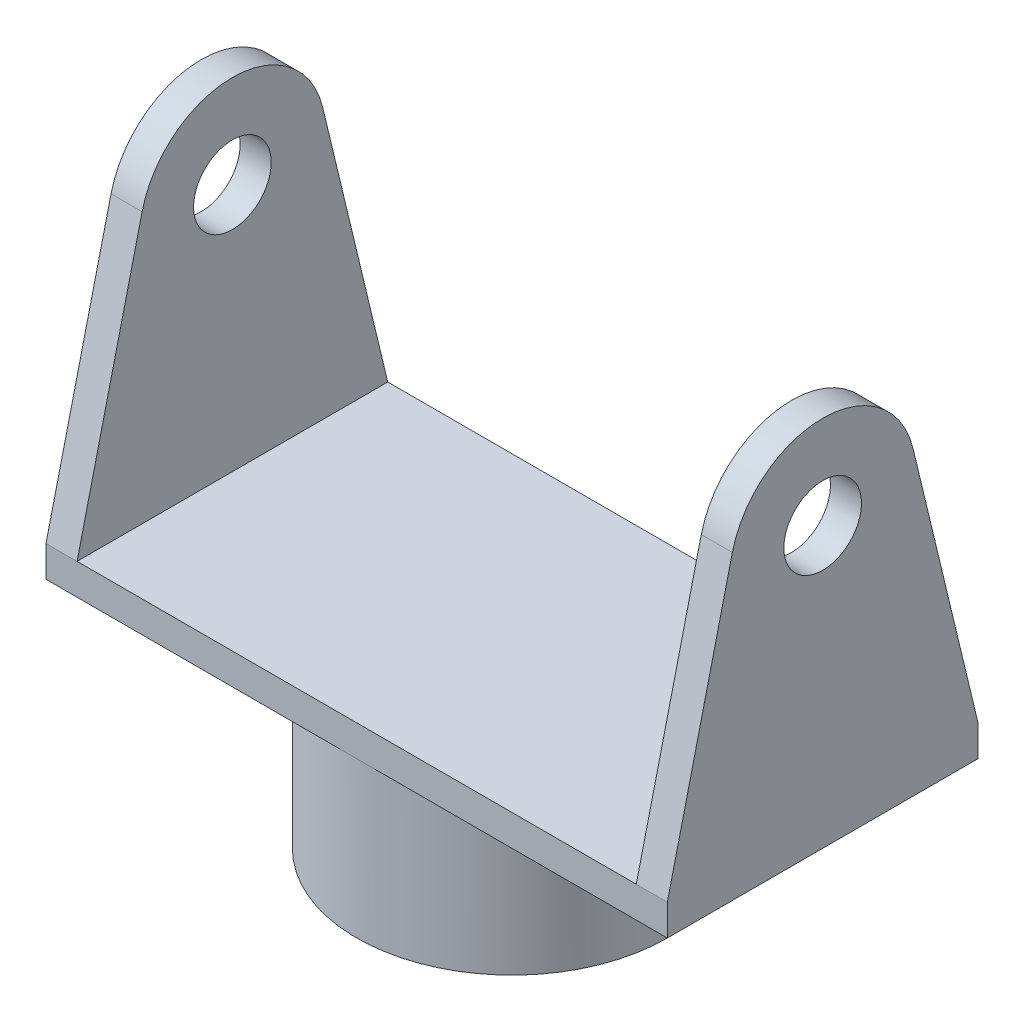
ISO-10303-21;
HEADER;
FILE_DESCRIPTION(('STEP AP214'),'2;1');
FILE_NAME('part.step','',(''),(''),'','','');
FILE_SCHEMA(('AUTOMOTIVE_DESIGN { 1 0 10303 214 1 1 1 1 }'));
ENDSEC;
DATA;
#1=APPLICATION_CONTEXT('core data for automotive mechanical design processes');
#2=APPLICATION_PROTOCOL_DEFINITION('international standard','automotive_design',2000,#1);
#3=PRODUCT_CONTEXT('',#1,'mechanical');
#4=PRODUCT('Part','Part','',(#3));
#5=PRODUCT_RELATED_PRODUCT_CATEGORY('part','',(#4));
#6=PRODUCT_DEFINITION_FORMATION('','',#4);
#7=PRODUCT_DEFINITION_CONTEXT('part definition',#1,'design');
#8=PRODUCT_DEFINITION('design','',#6,#7);
#9=PRODUCT_DEFINITION_SHAPE('','',#8);
#10=(LENGTH_UNIT() NAMED_UNIT(*) SI_UNIT(.MILLI.,.METRE.));
#11=(NAMED_UNIT(*) PLANE_ANGLE_UNIT() SI_UNIT($,.RADIAN.));
#12=(NAMED_UNIT(*) SI_UNIT($,.STERADIAN.) SOLID_ANGLE_UNIT());
#13=UNCERTAINTY_MEASURE_WITH_UNIT(LENGTH_MEASURE(1.E-05),#10,'distance_accuracy_value','');
#14=(GEOMETRIC_REPRESENTATION_CONTEXT(3) GLOBAL_UNCERTAINTY_ASSIGNED_CONTEXT((#13)) GLOBAL_UNIT_ASSIGNED_CONTEXT((#10,
#11,#12)) REPRESENTATION_CONTEXT('',''));
#15=CARTESIAN_POINT('',(0.,0.,0.));
#16=DIRECTION('',(0.,0.,1.));
#17=DIRECTION('',(1.,0.,0.));
#18=AXIS2_PLACEMENT_3D('',#15,#16,#17);
#19=CARTESIAN_POINT('',(0.,0.,0.));
#20=DIRECTION('',(0.,-1.,0.));
#21=DIRECTION('',(1.,0.,0.));
#22=AXIS2_PLACEMENT_3D('',#19,#20,#21);
#23=PLANE('',#22);
#24=DIRECTION('',(0.,0.,-1.));
#25=VECTOR('',#24,1.);
#26=CARTESIAN_POINT('',(-18.,0.,10.));
#27=LINE('',#26,#25);
#28=CARTESIAN_POINT('',(-18.,0.,10.));
#29=VERTEX_POINT('',#28);
#30=CARTESIAN_POINT('',(-18.,0.,-10.));
#31=VERTEX_POINT('',#30);
#32=EDGE_CURVE('E11',#29,#31,#27,.T.);
#33=ORIENTED_EDGE('',*,*,#32,.F.);
#34=DIRECTION('',(-1.,0.,0.));
#35=VECTOR('',#34,1.);
#36=CARTESIAN_POINT('',(-20.,0.,10.));
#37=LINE('',#36,#35);
#38=CARTESIAN_POINT('',(18.,0.,10.));
#39=VERTEX_POINT('',#38);
#40=EDGE_CURVE('E25',#39,#29,#37,.T.);
#41=ORIENTED_EDGE('',*,*,#40,.F.);
#42=DIRECTION('',(0.,0.,-1.));
#43=VECTOR('',#42,1.);
#44=CARTESIAN_POINT('',(18.,0.,10.));
#45=LINE('',#44,#43);
#46=CARTESIAN_POINT('',(18.,0.,-10.));
#47=VERTEX_POINT('',#46);
#48=EDGE_CURVE('E351',#39,#47,#45,.T.);
#49=ORIENTED_EDGE('',*,*,#48,.T.);
#50=DIRECTION('',(1.,0.,0.));
#51=VECTOR('',#50,1.);
#52=CARTESIAN_POINT('',(-20.,0.,-10.));
#53=LINE('',#52,#51);
#54=EDGE_CURVE('E347',#31,#47,#53,.T.);
#55=ORIENTED_EDGE('',*,*,#54,.F.);
#56=EDGE_LOOP('',(#33,#41,#49,#55));
#57=FACE_BOUND('',#56,.T.);
#58=ADVANCED_FACE('F17',(#57),#23,.F.);
#59=CARTESIAN_POINT('',(0.,-2.,0.));
#60=DIRECTION('',(0.,-1.,0.));
#61=DIRECTION('',(1.,0.,0.));
#62=AXIS2_PLACEMENT_3D('',#59,#60,#61);
#63=PLANE('',#62);
#64=CARTESIAN_POINT('',(0.,-2.,0.));
#65=DIRECTION('',(0.,-1.,0.));
#66=DIRECTION('',(1.,0.,0.));
#67=AXIS2_PLACEMENT_3D('',#64,#65,#66);
#68=CIRCLE('',#67,10.);
#69=CARTESIAN_POINT('',(0.,-2.,10.));
#70=VERTEX_POINT('',#69);
#71=CARTESIAN_POINT('',(0.,-2.,-10.));
#72=VERTEX_POINT('',#71);
#73=EDGE_CURVE('E343',#70,#72,#68,.T.);
#74=ORIENTED_EDGE('',*,*,#73,.F.);
#75=DIRECTION('',(-1.,0.,0.));
#76=VECTOR('',#75,1.);
#77=CARTESIAN_POINT('',(-20.,-2.,10.));
#78=LINE('',#77,#76);
#79=CARTESIAN_POINT('',(-20.,-2.,10.));
#80=VERTEX_POINT('',#79);
#81=EDGE_CURVE('E340',#70,#80,#78,.T.);
#82=ORIENTED_EDGE('',*,*,#81,.T.);
#83=DIRECTION('',(0.,0.,-1.));
#84=VECTOR('',#83,1.);
#85=CARTESIAN_POINT('',(-20.,-2.,10.));
#86=LINE('',#85,#84);
#87=CARTESIAN_POINT('',(-20.,-2.,-10.));
#88=VERTEX_POINT('',#87);
#89=EDGE_CURVE('E337',#80,#88,#86,.T.);
#90=ORIENTED_EDGE('',*,*,#89,.T.);
#91=DIRECTION('',(1.,0.,0.));
#92=VECTOR('',#91,1.);
#93=CARTESIAN_POINT('',(-20.,-2.,-10.));
#94=LINE('',#93,#92);
#95=EDGE_CURVE('E334',#88,#72,#94,.T.);
#96=ORIENTED_EDGE('',*,*,#95,.T.);
#97=EDGE_LOOP('',(#74,#82,#90,#96));
#98=FACE_BOUND('',#97,.T.);
#99=ADVANCED_FACE('F394',(#98),#63,.T.);
#100=CARTESIAN_POINT('',(20.,-2.,10.));
#101=DIRECTION('',(-1.,0.,0.));
#102=DIRECTION('',(0.,-1.,0.));
#103=AXIS2_PLACEMENT_3D('',#100,#101,#102);
#104=PLANE('',#103);
#105=DIRECTION('',(0.,1.,0.));
#106=VECTOR('',#105,1.);
#107=CARTESIAN_POINT('',(20.,-2.,-10.));
#108=LINE('',#107,#106);
#109=CARTESIAN_POINT('',(20.,-2.,-10.));
#110=VERTEX_POINT('',#109);
#111=CARTESIAN_POINT('',(20.,0.,-10.));
#112=VERTEX_POINT('',#111);
#113=EDGE_CURVE('E331',#110,#112,#108,.T.);
#114=ORIENTED_EDGE('',*,*,#113,.T.);
#115=DIRECTION('',(0.,0.97224941170306,0.233946749161116));
#116=VECTOR('',#115,1.);
#117=CARTESIAN_POINT('',(20.,0.,-10.));
#118=LINE('',#117,#116);
#119=CARTESIAN_POINT('',(20.,17.3988485893285,-5.81341575770165));
#120=VERTEX_POINT('',#119);
#121=EDGE_CURVE('E328',#112,#120,#118,.T.);
#122=ORIENTED_EDGE('',*,*,#121,.T.);
#123=CARTESIAN_POINT('',(20.,16.,0.));
#124=DIRECTION('',(1.,0.,0.));
#125=DIRECTION('',(0.,0.,1.));
#126=AXIS2_PLACEMENT_3D('',#123,#124,#125);
#127=CIRCLE('',#126,5.97934613045274);
#128=CARTESIAN_POINT('',(20.,17.3988485893285,5.81341575770164));
#129=VERTEX_POINT('',#128);
#130=EDGE_CURVE('E325',#120,#129,#127,.T.);
#131=ORIENTED_EDGE('',*,*,#130,.T.);
#132=DIRECTION('',(0.,-0.97224941170306,0.233946749161116));
#133=VECTOR('',#132,1.);
#134=CARTESIAN_POINT('',(20.,0.,10.));
#135=LINE('',#134,#133);
#136=CARTESIAN_POINT('',(20.,0.,10.));
#137=VERTEX_POINT('',#136);
#138=EDGE_CURVE('E322',#129,#137,#135,.T.);
#139=ORIENTED_EDGE('',*,*,#138,.T.);
#140=DIRECTION('',(0.,1.,0.));
#141=VECTOR('',#140,1.);
#142=CARTESIAN_POINT('',(20.,-2.,10.));
#143=LINE('',#142,#141);
#144=CARTESIAN_POINT('',(20.,-2.,10.));
#145=VERTEX_POINT('',#144);
#146=EDGE_CURVE('E318',#145,#137,#143,.T.);
#147=ORIENTED_EDGE('',*,*,#146,.F.);
#148=DIRECTION('',(0.,0.,1.));
#149=VECTOR('',#148,1.);
#150=CARTESIAN_POINT('',(20.,-2.,10.));
#151=LINE('',#150,#149);
#152=EDGE_CURVE('E314',#110,#145,#151,.T.);
#153=ORIENTED_EDGE('',*,*,#152,.F.);
#154=EDGE_LOOP('',(#114,#122,#131,#139,#147,#153));
#155=FACE_BOUND('',#154,.T.);
#156=CARTESIAN_POINT('',(20.,16.,0.));
#157=DIRECTION('',(1.,0.,0.));
#158=DIRECTION('',(0.,0.,1.));
#159=AXIS2_PLACEMENT_3D('',#156,#157,#158);
#160=CIRCLE('',#159,2.5);
#161=CARTESIAN_POINT('',(20.,16.,2.5));
#162=VERTEX_POINT('',#161);
#163=EDGE_CURVE('E310',#162,#162,#160,.T.);
#164=ORIENTED_EDGE('',*,*,#163,.F.);
#165=EDGE_LOOP('',(#164));
#166=FACE_BOUND('',#165,.T.);
#167=ADVANCED_FACE('F379',(#155,#166),#104,.F.);
#168=CARTESIAN_POINT('',(-20.,-2.,10.));
#169=DIRECTION('',(0.,0.,-1.));
#170=DIRECTION('',(0.,1.,0.));
#171=AXIS2_PLACEMENT_3D('',#168,#169,#170);
#172=PLANE('',#171);
#173=DIRECTION('',(-1.,0.,0.));
#174=VECTOR('',#173,1.);
#175=CARTESIAN_POINT('',(-20.,0.,10.));
#176=LINE('',#175,#174);
#177=EDGE_CURVE('E307',#137,#39,#176,.T.);
#178=ORIENTED_EDGE('',*,*,#177,.T.);
#179=ORIENTED_EDGE('',*,*,#40,.T.);
#180=DIRECTION('',(-1.,0.,0.));
#181=VECTOR('',#180,1.);
#182=CARTESIAN_POINT('',(-18.,0.,10.));
#183=LINE('',#182,#181);
#184=CARTESIAN_POINT('',(-20.,0.,10.));
#185=VERTEX_POINT('',#184);
#186=EDGE_CURVE('E174',#29,#185,#183,.T.);
#187=ORIENTED_EDGE('',*,*,#186,.T.);
#188=DIRECTION('',(0.,1.,0.));
#189=VECTOR('',#188,1.);
#190=CARTESIAN_POINT('',(-20.,-2.,10.));
#191=LINE('',#190,#189);
#192=EDGE_CURVE('E301',#80,#185,#191,.T.);
#193=ORIENTED_EDGE('',*,*,#192,.F.);
#194=ORIENTED_EDGE('',*,*,#81,.F.);
#195=DIRECTION('',(-1.,0.,0.));
#196=VECTOR('',#195,1.);
#197=CARTESIAN_POINT('',(-20.,-2.,10.));
#198=LINE('',#197,#196);
#199=EDGE_CURVE('E297',#145,#70,#198,.T.);
#200=ORIENTED_EDGE('',*,*,#199,.F.);
#201=ORIENTED_EDGE('',*,*,#146,.T.);
#202=EDGE_LOOP('',(#178,#179,#187,#193,#194,#200,#201));
#203=FACE_BOUND('',#202,.T.);
#204=ADVANCED_FACE('F356',(#203),#172,.F.);
#205=CARTESIAN_POINT('',(-20.,-2.,10.));
#206=DIRECTION('',(1.,0.,0.));
#207=DIRECTION('',(0.,0.,1.));
#208=AXIS2_PLACEMENT_3D('',#205,#206,#207);
#209=PLANE('',#208);
#210=ORIENTED_EDGE('',*,*,#192,.T.);
#211=DIRECTION('',(0.,-0.97224941170306,0.233946749161116));
#212=VECTOR('',#211,1.);
#213=CARTESIAN_POINT('',(-20.,0.,10.));
#214=LINE('',#213,#212);
#215=CARTESIAN_POINT('',(-20.,17.3988485893285,5.81341575770164));
#216=VERTEX_POINT('',#215);
#217=EDGE_CURVE('E294',#216,#185,#214,.T.);
#218=ORIENTED_EDGE('',*,*,#217,.F.);
#219=CARTESIAN_POINT('',(-20.,16.,0.));
#220=DIRECTION('',(1.,0.,0.));
#221=DIRECTION('',(0.,0.,1.));
#222=AXIS2_PLACEMENT_3D('',#219,#220,#221);
#223=CIRCLE('',#222,5.97934613045274);
#224=CARTESIAN_POINT('',(-20.,17.3988485893285,-5.81341575770165));
#225=VERTEX_POINT('',#224);
#226=EDGE_CURVE('E179',#225,#216,#223,.T.);
#227=ORIENTED_EDGE('',*,*,#226,.F.);
#228=DIRECTION('',(0.,0.97224941170306,0.233946749161116));
#229=VECTOR('',#228,1.);
#230=CARTESIAN_POINT('',(-20.,0.,-10.));
#231=LINE('',#230,#229);
#232=CARTESIAN_POINT('',(-20.,0.,-10.));
#233=VERTEX_POINT('',#232);
#234=EDGE_CURVE('E288',#233,#225,#231,.T.);
#235=ORIENTED_EDGE('',*,*,#234,.F.);
#236=DIRECTION('',(0.,1.,0.));
#237=VECTOR('',#236,1.);
#238=CARTESIAN_POINT('',(-20.,-2.,-10.));
#239=LINE('',#238,#237);
#240=EDGE_CURVE('E284',#88,#233,#239,.T.);
#241=ORIENTED_EDGE('',*,*,#240,.F.);
#242=ORIENTED_EDGE('',*,*,#89,.F.);
#243=EDGE_LOOP('',(#210,#218,#227,#235,#241,#242));
#244=FACE_BOUND('',#243,.T.);
#245=CARTESIAN_POINT('',(-20.,16.,0.));
#246=DIRECTION('',(1.,0.,0.));
#247=DIRECTION('',(0.,0.,1.));
#248=AXIS2_PLACEMENT_3D('',#245,#246,#247);
#249=CIRCLE('',#248,2.5);
#250=CARTESIAN_POINT('',(-20.,16.,2.5));
#251=VERTEX_POINT('',#250);
#252=EDGE_CURVE('E280',#251,#251,#249,.T.);
#253=ORIENTED_EDGE('',*,*,#252,.T.);
#254=EDGE_LOOP('',(#253));
#255=FACE_BOUND('',#254,.T.);
#256=ADVANCED_FACE('F406',(#244,#255),#209,.F.);
#257=CARTESIAN_POINT('',(-20.,-2.,-10.));
#258=DIRECTION('',(0.,0.,1.));
#259=DIRECTION('',(0.,-1.,0.));
#260=AXIS2_PLACEMENT_3D('',#257,#258,#259);
#261=PLANE('',#260);
#262=DIRECTION('',(1.,0.,0.));
#263=VECTOR('',#262,1.);
#264=CARTESIAN_POINT('',(-20.,0.,-10.));
#265=LINE('',#264,#263);
#266=EDGE_CURVE('E276',#233,#31,#265,.T.);
#267=ORIENTED_EDGE('',*,*,#266,.T.);
#268=ORIENTED_EDGE('',*,*,#54,.T.);
#269=DIRECTION('',(1.,0.,0.));
#270=VECTOR('',#269,1.);
#271=CARTESIAN_POINT('',(18.,0.,-10.));
#272=LINE('',#271,#270);
#273=EDGE_CURVE('E272',#47,#112,#272,.T.);
#274=ORIENTED_EDGE('',*,*,#273,.T.);
#275=ORIENTED_EDGE('',*,*,#113,.F.);
#276=DIRECTION('',(1.,0.,0.));
#277=VECTOR('',#276,1.);
#278=CARTESIAN_POINT('',(-20.,-2.,-10.));
#279=LINE('',#278,#277);
#280=EDGE_CURVE('E268',#72,#110,#279,.T.);
#281=ORIENTED_EDGE('',*,*,#280,.F.);
#282=ORIENTED_EDGE('',*,*,#95,.F.);
#283=ORIENTED_EDGE('',*,*,#240,.T.);
#284=EDGE_LOOP('',(#267,#268,#274,#275,#281,#282,#283));
#285=FACE_BOUND('',#284,.T.);
#286=ADVANCED_FACE('F371',(#285),#261,.F.);
#287=CARTESIAN_POINT('',(0.,-2.,0.));
#288=DIRECTION('',(0.,-1.,0.));
#289=DIRECTION('',(1.,0.,0.));
#290=AXIS2_PLACEMENT_3D('',#287,#288,#289);
#291=PLANE('',#290);
#292=CARTESIAN_POINT('',(0.,-2.,0.));
#293=DIRECTION('',(0.,-1.,0.));
#294=DIRECTION('',(1.,0.,0.));
#295=AXIS2_PLACEMENT_3D('',#292,#293,#294);
#296=CIRCLE('',#295,10.);
#297=EDGE_CURVE('E264',#72,#70,#296,.T.);
#298=ORIENTED_EDGE('',*,*,#297,.F.);
#299=ORIENTED_EDGE('',*,*,#280,.T.);
#300=ORIENTED_EDGE('',*,*,#152,.T.);
#301=ORIENTED_EDGE('',*,*,#199,.T.);
#302=EDGE_LOOP('',(#298,#299,#300,#301));
#303=FACE_BOUND('',#302,.T.);
#304=ADVANCED_FACE('F412',(#303),#291,.T.);
#305=CARTESIAN_POINT('',(0.,-12.,0.));
#306=DIRECTION('',(0.,-1.,0.));
#307=DIRECTION('',(1.,0.,0.));
#308=AXIS2_PLACEMENT_3D('',#305,#306,#307);
#309=PLANE('',#308);
#310=CARTESIAN_POINT('',(0.,-12.,0.));
#311=DIRECTION('',(0.,-1.,0.));
#312=DIRECTION('',(1.,0.,0.));
#313=AXIS2_PLACEMENT_3D('',#310,#311,#312);
#314=CIRCLE('',#313,10.);
#315=CARTESIAN_POINT('',(10.,-12.,0.));
#316=VERTEX_POINT('',#315);
#317=EDGE_CURVE('E260',#316,#316,#314,.T.);
#318=ORIENTED_EDGE('',*,*,#317,.T.);
#319=EDGE_LOOP('',(#318));
#320=FACE_BOUND('',#319,.T.);
#321=DIRECTION('',(-1.,0.,0.));
#322=VECTOR('',#321,1.);
#323=CARTESIAN_POINT('',(4.76969600708473,-12.,1.5));
#324=LINE('',#323,#322);
#325=CARTESIAN_POINT('',(6.,-12.,1.5));
#326=VERTEX_POINT('',#325);
#327=CARTESIAN_POINT('',(4.76969600708473,-12.,1.5));
#328=VERTEX_POINT('',#327);
#329=EDGE_CURVE('E256',#326,#328,#324,.T.);
#330=ORIENTED_EDGE('',*,*,#329,.F.);
#331=DIRECTION('',(0.,0.,1.));
#332=VECTOR('',#331,1.);
#333=CARTESIAN_POINT('',(6.,-12.,-1.5));
#334=LINE('',#333,#332);
#335=CARTESIAN_POINT('',(6.,-12.,-1.5));
#336=VERTEX_POINT('',#335);
#337=EDGE_CURVE('E252',#336,#326,#334,.T.);
#338=ORIENTED_EDGE('',*,*,#337,.F.);
#339=DIRECTION('',(1.,0.,0.));
#340=VECTOR('',#339,1.);
#341=CARTESIAN_POINT('',(4.76969600708473,-12.,-1.5));
#342=LINE('',#341,#340);
#343=CARTESIAN_POINT('',(4.76969600708473,-12.,-1.5));
#344=VERTEX_POINT('',#343);
#345=EDGE_CURVE('E248',#344,#336,#342,.T.);
#346=ORIENTED_EDGE('',*,*,#345,.F.);
#347=CARTESIAN_POINT('',(0.,-12.,0.));
#348=DIRECTION('',(0.,-1.,0.));
#349=DIRECTION('',(1.,0.,0.));
#350=AXIS2_PLACEMENT_3D('',#347,#348,#349);
#351=CIRCLE('',#350,5.);
#352=EDGE_CURVE('E244',#328,#344,#351,.T.);
#353=ORIENTED_EDGE('',*,*,#352,.F.);
#354=EDGE_LOOP('',(#330,#338,#346,#353));
#355=FACE_BOUND('',#354,.T.);
#356=ADVANCED_FACE('F415',(#320,#355),#309,.T.);
#357=CARTESIAN_POINT('',(0.,-12.,0.));
#358=DIRECTION('',(0.,1.,0.));
#359=DIRECTION('',(-1.,0.,0.));
#360=AXIS2_PLACEMENT_3D('',#357,#358,#359);
#361=CYLINDRICAL_SURFACE('',#360,10.);
#362=ORIENTED_EDGE('',*,*,#317,.F.);
#363=EDGE_LOOP('',(#362));
#364=FACE_BOUND('',#363,.T.);
#365=ORIENTED_EDGE('',*,*,#73,.T.);
#366=ORIENTED_EDGE('',*,*,#297,.T.);
#367=EDGE_LOOP('',(#365,#366));
#368=FACE_BOUND('',#367,.T.);
#369=ADVANCED_FACE('F419',(#364,#368),#361,.T.);
#370=CARTESIAN_POINT('',(6.,-12.,-1.5));
#371=DIRECTION('',(-1.,0.,0.));
#372=DIRECTION('',(0.,-1.,0.));
#373=AXIS2_PLACEMENT_3D('',#370,#371,#372);
#374=PLANE('',#373);
#375=DIRECTION('',(0.,0.,1.));
#376=VECTOR('',#375,1.);
#377=CARTESIAN_POINT('',(6.,-2.,-1.5));
#378=LINE('',#377,#376);
#379=CARTESIAN_POINT('',(6.,-2.,-1.5));
#380=VERTEX_POINT('',#379);
#381=CARTESIAN_POINT('',(6.,-2.,1.5));
#382=VERTEX_POINT('',#381);
#383=EDGE_CURVE('E240',#380,#382,#378,.T.);
#384=ORIENTED_EDGE('',*,*,#383,.F.);
#385=DIRECTION('',(0.,1.,0.));
#386=VECTOR('',#385,1.);
#387=CARTESIAN_POINT('',(6.,-12.,-1.5));
#388=LINE('',#387,#386);
#389=EDGE_CURVE('E236',#336,#380,#388,.T.);
#390=ORIENTED_EDGE('',*,*,#389,.F.);
#391=ORIENTED_EDGE('',*,*,#337,.T.);
#392=DIRECTION('',(0.,1.,0.));
#393=VECTOR('',#392,1.);
#394=CARTESIAN_POINT('',(6.,-12.,1.5));
#395=LINE('',#394,#393);
#396=EDGE_CURVE('E233',#326,#382,#395,.T.);
#397=ORIENTED_EDGE('',*,*,#396,.T.);
#398=EDGE_LOOP('',(#384,#390,#391,#397));
#399=FACE_BOUND('',#398,.T.);
#400=ADVANCED_FACE('F423',(#399),#374,.T.);
#401=CARTESIAN_POINT('',(4.76969600708473,-12.,1.5));
#402=DIRECTION('',(0.,0.,-1.));
#403=DIRECTION('',(0.,1.,0.));
#404=AXIS2_PLACEMENT_3D('',#401,#402,#403);
#405=PLANE('',#404);
#406=DIRECTION('',(-1.,0.,0.));
#407=VECTOR('',#406,1.);
#408=CARTESIAN_POINT('',(4.76969600708473,-2.,1.5));
#409=LINE('',#408,#407);
#410=CARTESIAN_POINT('',(4.76969600708473,-2.,1.5));
#411=VERTEX_POINT('',#410);
#412=EDGE_CURVE('E229',#382,#411,#409,.T.);
#413=ORIENTED_EDGE('',*,*,#412,.F.);
#414=ORIENTED_EDGE('',*,*,#396,.F.);
#415=ORIENTED_EDGE('',*,*,#329,.T.);
#416=DIRECTION('',(0.,1.,0.));
#417=VECTOR('',#416,1.);
#418=CARTESIAN_POINT('',(4.76969600708473,-12.,1.5));
#419=LINE('',#418,#417);
#420=EDGE_CURVE('E226',#328,#411,#419,.T.);
#421=ORIENTED_EDGE('',*,*,#420,.T.);
#422=EDGE_LOOP('',(#413,#414,#415,#421));
#423=FACE_BOUND('',#422,.T.);
#424=ADVANCED_FACE('F427',(#423),#405,.T.);
#425=CARTESIAN_POINT('',(0.,-12.,0.));
#426=DIRECTION('',(0.,1.,0.));
#427=DIRECTION('',(-1.,0.,0.));
#428=AXIS2_PLACEMENT_3D('',#425,#426,#427);
#429=CYLINDRICAL_SURFACE('',#428,5.);
#430=CARTESIAN_POINT('',(0.,-2.,0.));
#431=DIRECTION('',(0.,-1.,0.));
#432=DIRECTION('',(1.,0.,0.));
#433=AXIS2_PLACEMENT_3D('',#430,#431,#432);
#434=CIRCLE('',#433,5.);
#435=CARTESIAN_POINT('',(4.76969600708473,-2.,-1.5));
#436=VERTEX_POINT('',#435);
#437=EDGE_CURVE('E222',#411,#436,#434,.T.);
#438=ORIENTED_EDGE('',*,*,#437,.F.);
#439=ORIENTED_EDGE('',*,*,#420,.F.);
#440=ORIENTED_EDGE('',*,*,#352,.T.);
#441=DIRECTION('',(0.,1.,0.));
#442=VECTOR('',#441,1.);
#443=CARTESIAN_POINT('',(4.76969600708473,-12.,-1.5));
#444=LINE('',#443,#442);
#445=EDGE_CURVE('E219',#344,#436,#444,.T.);
#446=ORIENTED_EDGE('',*,*,#445,.T.);
#447=EDGE_LOOP('',(#438,#439,#440,#446));
#448=FACE_BOUND('',#447,.T.);
#449=ADVANCED_FACE('F431',(#448),#429,.F.);
#450=CARTESIAN_POINT('',(4.76969600708473,-12.,-1.5));
#451=DIRECTION('',(0.,0.,1.));
#452=DIRECTION('',(0.,-1.,0.));
#453=AXIS2_PLACEMENT_3D('',#450,#451,#452);
#454=PLANE('',#453);
#455=DIRECTION('',(1.,0.,0.));
#456=VECTOR('',#455,1.);
#457=CARTESIAN_POINT('',(4.76969600708473,-2.,-1.5));
#458=LINE('',#457,#456);
#459=EDGE_CURVE('E215',#436,#380,#458,.T.);
#460=ORIENTED_EDGE('',*,*,#459,.F.);
#461=ORIENTED_EDGE('',*,*,#445,.F.);
#462=ORIENTED_EDGE('',*,*,#345,.T.);
#463=ORIENTED_EDGE('',*,*,#389,.T.);
#464=EDGE_LOOP('',(#460,#461,#462,#463));
#465=FACE_BOUND('',#464,.T.);
#466=ADVANCED_FACE('F435',(#465),#454,.T.);
#467=CARTESIAN_POINT('',(0.,-2.,0.));
#468=DIRECTION('',(0.,-1.,0.));
#469=DIRECTION('',(1.,0.,0.));
#470=AXIS2_PLACEMENT_3D('',#467,#468,#469);
#471=PLANE('',#470);
#472=ORIENTED_EDGE('',*,*,#459,.T.);
#473=ORIENTED_EDGE('',*,*,#383,.T.);
#474=ORIENTED_EDGE('',*,*,#412,.T.);
#475=ORIENTED_EDGE('',*,*,#437,.T.);
#476=EDGE_LOOP('',(#472,#473,#474,#475));
#477=FACE_BOUND('',#476,.T.);
#478=ADVANCED_FACE('F391',(#477),#471,.T.);
#479=CARTESIAN_POINT('',(18.,0.,10.));
#480=DIRECTION('',(0.,0.233946749161116,0.97224941170306));
#481=DIRECTION('',(0.,-0.97224941170306,0.233946749161116));
#482=AXIS2_PLACEMENT_3D('',#479,#480,#481);
#483=PLANE('',#482);
#484=ORIENTED_EDGE('',*,*,#138,.F.);
#485=DIRECTION('',(1.,0.,0.));
#486=VECTOR('',#485,1.);
#487=CARTESIAN_POINT('',(18.,17.3988485893285,5.81341575770164));
#488=LINE('',#487,#486);
#489=CARTESIAN_POINT('',(18.,17.3988485893285,5.81341575770164));
#490=VERTEX_POINT('',#489);
#491=EDGE_CURVE('E211',#490,#129,#488,.T.);
#492=ORIENTED_EDGE('',*,*,#491,.F.);
#493=DIRECTION('',(0.,-0.97224941170306,0.233946749161116));
#494=VECTOR('',#493,1.);
#495=CARTESIAN_POINT('',(18.,0.,10.));
#496=LINE('',#495,#494);
#497=EDGE_CURVE('E207',#490,#39,#496,.T.);
#498=ORIENTED_EDGE('',*,*,#497,.T.);
#499=ORIENTED_EDGE('',*,*,#177,.F.);
#500=EDGE_LOOP('',(#484,#492,#498,#499));
#501=FACE_BOUND('',#500,.T.);
#502=ADVANCED_FACE('F364',(#501),#483,.T.);
#503=CARTESIAN_POINT('',(18.,16.,0.));
#504=DIRECTION('',(1.,0.,0.));
#505=DIRECTION('',(0.,0.,1.));
#506=AXIS2_PLACEMENT_3D('',#503,#504,#505);
#507=CYLINDRICAL_SURFACE('',#506,5.97934613045274);
#508=ORIENTED_EDGE('',*,*,#130,.F.);
#509=DIRECTION('',(1.,0.,0.));
#510=VECTOR('',#509,1.);
#511=CARTESIAN_POINT('',(18.,17.3988485893285,-5.81341575770165));
#512=LINE('',#511,#510);
#513=CARTESIAN_POINT('',(18.,17.3988485893285,-5.81341575770165));
#514=VERTEX_POINT('',#513);
#515=EDGE_CURVE('E203',#514,#120,#512,.T.);
#516=ORIENTED_EDGE('',*,*,#515,.F.);
#517=CARTESIAN_POINT('',(18.,16.,0.));
#518=DIRECTION('',(1.,0.,0.));
#519=DIRECTION('',(0.,0.,1.));
#520=AXIS2_PLACEMENT_3D('',#517,#518,#519);
#521=CIRCLE('',#520,5.97934613045274);
#522=EDGE_CURVE('E199',#514,#490,#521,.T.);
#523=ORIENTED_EDGE('',*,*,#522,.T.);
#524=ORIENTED_EDGE('',*,*,#491,.T.);
#525=EDGE_LOOP('',(#508,#516,#523,#524));
#526=FACE_BOUND('',#525,.T.);
#527=ADVANCED_FACE('F382',(#526),#507,.T.);
#528=CARTESIAN_POINT('',(18.,0.,-10.));
#529=DIRECTION('',(0.,0.233946749161116,-0.97224941170306));
#530=DIRECTION('',(0.,0.97224941170306,0.233946749161116));
#531=AXIS2_PLACEMENT_3D('',#528,#529,#530);
#532=PLANE('',#531);
#533=ORIENTED_EDGE('',*,*,#121,.F.);
#534=ORIENTED_EDGE('',*,*,#273,.F.);
#535=DIRECTION('',(0.,0.97224941170306,0.233946749161116));
#536=VECTOR('',#535,1.);
#537=CARTESIAN_POINT('',(18.,0.,-10.));
#538=LINE('',#537,#536);
#539=EDGE_CURVE('E195',#47,#514,#538,.T.);
#540=ORIENTED_EDGE('',*,*,#539,.T.);
#541=ORIENTED_EDGE('',*,*,#515,.T.);
#542=EDGE_LOOP('',(#533,#534,#540,#541));
#543=FACE_BOUND('',#542,.T.);
#544=ADVANCED_FACE('F376',(#543),#532,.T.);
#545=CARTESIAN_POINT('',(18.,16.,0.));
#546=DIRECTION('',(1.,0.,0.));
#547=DIRECTION('',(0.,0.,1.));
#548=AXIS2_PLACEMENT_3D('',#545,#546,#547);
#549=PLANE('',#548);
#550=CARTESIAN_POINT('',(18.,16.,0.));
#551=DIRECTION('',(1.,0.,0.));
#552=DIRECTION('',(0.,0.,1.));
#553=AXIS2_PLACEMENT_3D('',#550,#551,#552);
#554=CIRCLE('',#553,2.5);
#555=CARTESIAN_POINT('',(18.,16.,2.5));
#556=VERTEX_POINT('',#555);
#557=EDGE_CURVE('E176',#556,#556,#554,.T.);
#558=ORIENTED_EDGE('',*,*,#557,.T.);
#559=EDGE_LOOP('',(#558));
#560=FACE_BOUND('',#559,.T.);
#561=ORIENTED_EDGE('',*,*,#497,.F.);
#562=ORIENTED_EDGE('',*,*,#522,.F.);
#563=ORIENTED_EDGE('',*,*,#539,.F.);
#564=ORIENTED_EDGE('',*,*,#48,.F.);
#565=EDGE_LOOP('',(#561,#562,#563,#564));
#566=FACE_BOUND('',#565,.T.);
#567=ADVANCED_FACE('F368',(#560,#566),#549,.F.);
#568=CARTESIAN_POINT('',(18.,16.,0.));
#569=DIRECTION('',(1.,0.,0.));
#570=DIRECTION('',(0.,0.,1.));
#571=AXIS2_PLACEMENT_3D('',#568,#569,#570);
#572=CYLINDRICAL_SURFACE('',#571,2.5);
#573=ORIENTED_EDGE('',*,*,#557,.F.);
#574=EDGE_LOOP('',(#573));
#575=FACE_BOUND('',#574,.T.);
#576=ORIENTED_EDGE('',*,*,#163,.T.);
#577=EDGE_LOOP('',(#576));
#578=FACE_BOUND('',#577,.T.);
#579=ADVANCED_FACE('F485',(#575,#578),#572,.F.);
#580=CARTESIAN_POINT('',(-18.,16.,0.));
#581=DIRECTION('',(-1.,0.,0.));
#582=DIRECTION('',(0.,0.,1.));
#583=AXIS2_PLACEMENT_3D('',#580,#581,#582);
#584=PLANE('',#583);
#585=DIRECTION('',(0.,-0.97224941170306,0.233946749161116));
#586=VECTOR('',#585,1.);
#587=CARTESIAN_POINT('',(-18.,0.,10.));
#588=LINE('',#587,#586);
#589=CARTESIAN_POINT('',(-18.,17.3988485893285,5.81341575770164));
#590=VERTEX_POINT('',#589);
#591=EDGE_CURVE('E157',#590,#29,#588,.T.);
#592=ORIENTED_EDGE('',*,*,#591,.T.);
#593=ORIENTED_EDGE('',*,*,#32,.T.);
#594=DIRECTION('',(0.,0.97224941170306,0.233946749161116));
#595=VECTOR('',#594,1.);
#596=CARTESIAN_POINT('',(-18.,0.,-10.));
#597=LINE('',#596,#595);
#598=CARTESIAN_POINT('',(-18.,17.3988485893285,-5.81341575770165));
#599=VERTEX_POINT('',#598);
#600=EDGE_CURVE('E160',#31,#599,#597,.T.);
#601=ORIENTED_EDGE('',*,*,#600,.T.);
#602=CARTESIAN_POINT('',(-18.,16.,0.));
#603=DIRECTION('',(1.,0.,0.));
#604=DIRECTION('',(0.,0.,1.));
#605=AXIS2_PLACEMENT_3D('',#602,#603,#604);
#606=CIRCLE('',#605,5.97934613045274);
#607=EDGE_CURVE('E153',#599,#590,#606,.T.);
#608=ORIENTED_EDGE('',*,*,#607,.T.);
#609=EDGE_LOOP('',(#592,#593,#601,#608));
#610=FACE_BOUND('',#609,.T.);
#611=CARTESIAN_POINT('',(-18.,16.,0.));
#612=DIRECTION('',(1.,0.,0.));
#613=DIRECTION('',(0.,0.,1.));
#614=AXIS2_PLACEMENT_3D('',#611,#612,#613);
#615=CIRCLE('',#614,2.5);
#616=CARTESIAN_POINT('',(-18.,16.,2.5));
#617=VERTEX_POINT('',#616);
#618=EDGE_CURVE('E166',#617,#617,#615,.T.);
#619=ORIENTED_EDGE('',*,*,#618,.F.);
#620=EDGE_LOOP('',(#619));
#621=FACE_BOUND('',#620,.T.);
#622=ADVANCED_FACE('F155',(#610,#621),#584,.F.);
#623=CARTESIAN_POINT('',(-18.,0.,10.));
#624=DIRECTION('',(0.,-0.233946749161116,-0.97224941170306));
#625=DIRECTION('',(0.,0.97224941170306,-0.233946749161116));
#626=AXIS2_PLACEMENT_3D('',#623,#624,#625);
#627=PLANE('',#626);
#628=ORIENTED_EDGE('',*,*,#217,.T.);
#629=ORIENTED_EDGE('',*,*,#186,.F.);
#630=ORIENTED_EDGE('',*,*,#591,.F.);
#631=DIRECTION('',(-1.,0.,0.));
#632=VECTOR('',#631,1.);
#633=CARTESIAN_POINT('',(-18.,17.3988485893285,5.81341575770164));
#634=LINE('',#633,#632);
#635=EDGE_CURVE('E172',#590,#216,#634,.T.);
#636=ORIENTED_EDGE('',*,*,#635,.T.);
#637=EDGE_LOOP('',(#628,#629,#630,#636));
#638=FACE_BOUND('',#637,.T.);
#639=ADVANCED_FACE('F171',(#638),#627,.F.);
#640=CARTESIAN_POINT('',(-18.,0.,-10.));
#641=DIRECTION('',(0.,-0.233946749161116,0.97224941170306));
#642=DIRECTION('',(0.,-0.97224941170306,-0.233946749161116));
#643=AXIS2_PLACEMENT_3D('',#640,#641,#642);
#644=PLANE('',#643);
#645=ORIENTED_EDGE('',*,*,#234,.T.);
#646=DIRECTION('',(-1.,0.,0.));
#647=VECTOR('',#646,1.);
#648=CARTESIAN_POINT('',(-18.,17.3988485893285,-5.81341575770165));
#649=LINE('',#648,#647);
#650=EDGE_CURVE('E181',#599,#225,#649,.T.);
#651=ORIENTED_EDGE('',*,*,#650,.F.);
#652=ORIENTED_EDGE('',*,*,#600,.F.);
#653=ORIENTED_EDGE('',*,*,#266,.F.);
#654=EDGE_LOOP('',(#645,#651,#652,#653));
#655=FACE_BOUND('',#654,.T.);
#656=ADVANCED_FACE('F515',(#655),#644,.F.);
#657=CARTESIAN_POINT('',(-18.,16.,0.));
#658=DIRECTION('',(-1.,0.,0.));
#659=DIRECTION('',(0.,0.,-1.));
#660=AXIS2_PLACEMENT_3D('',#657,#658,#659);
#661=CYLINDRICAL_SURFACE('',#660,5.97934613045274);
#662=ORIENTED_EDGE('',*,*,#226,.T.);
#663=ORIENTED_EDGE('',*,*,#635,.F.);
#664=ORIENTED_EDGE('',*,*,#607,.F.);
#665=ORIENTED_EDGE('',*,*,#650,.T.);
#666=EDGE_LOOP('',(#662,#663,#664,#665));
#667=FACE_BOUND('',#666,.T.);
#668=ADVANCED_FACE('F178',(#667),#661,.T.);
#669=CARTESIAN_POINT('',(-18.,16.,0.));
#670=DIRECTION('',(-1.,0.,0.));
#671=DIRECTION('',(0.,0.,-1.));
#672=AXIS2_PLACEMENT_3D('',#669,#670,#671);
#673=CYLINDRICAL_SURFACE('',#672,2.5);
#674=ORIENTED_EDGE('',*,*,#618,.T.);
#675=EDGE_LOOP('',(#674));
#676=FACE_BOUND('',#675,.T.);
#677=ORIENTED_EDGE('',*,*,#252,.F.);
#678=EDGE_LOOP('',(#677));
#679=FACE_BOUND('',#678,.T.);
#680=ADVANCED_FACE('F535',(#676,#679),#673,.F.);
#681=CLOSED_SHELL('',(#58,#99,#167,#204,#256,#286,#304,#356,#369,#400,#424,#449,#466,#478,#502,
#527,#544,#567,#579,#622,#639,#656,#668,#680));
#682=MANIFOLD_SOLID_BREP('B1',#681);
#683=ADVANCED_BREP_SHAPE_REPRESENTATION('',(#18,#682),#14);
#684=SHAPE_DEFINITION_REPRESENTATION(#9,#683);
ENDSEC;
END-ISO-10303-21;
